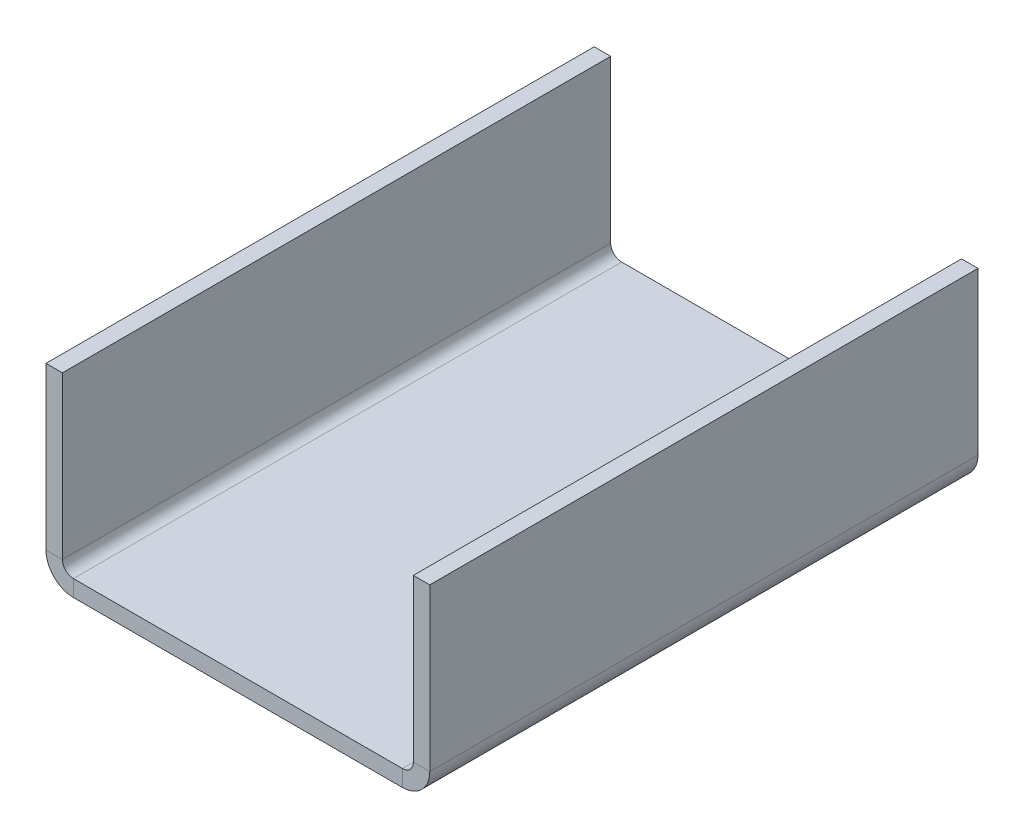
ISO-10303-21;
HEADER;
FILE_DESCRIPTION(('STEP AP214'),'2;1');
FILE_NAME('part.step','',(''),(''),'','','');
FILE_SCHEMA(('AUTOMOTIVE_DESIGN { 1 0 10303 214 1 1 1 1 }'));
ENDSEC;
DATA;
#1=APPLICATION_CONTEXT('core data for automotive mechanical design processes');
#2=APPLICATION_PROTOCOL_DEFINITION('international standard','automotive_design',2000,#1);
#3=PRODUCT_CONTEXT('',#1,'mechanical');
#4=PRODUCT('Part','Part','',(#3));
#5=PRODUCT_RELATED_PRODUCT_CATEGORY('part','',(#4));
#6=PRODUCT_DEFINITION_FORMATION('','',#4);
#7=PRODUCT_DEFINITION_CONTEXT('part definition',#1,'design');
#8=PRODUCT_DEFINITION('design','',#6,#7);
#9=PRODUCT_DEFINITION_SHAPE('','',#8);
#10=(LENGTH_UNIT() NAMED_UNIT(*) SI_UNIT(.MILLI.,.METRE.));
#11=(NAMED_UNIT(*) PLANE_ANGLE_UNIT() SI_UNIT($,.RADIAN.));
#12=(NAMED_UNIT(*) SI_UNIT($,.STERADIAN.) SOLID_ANGLE_UNIT());
#13=UNCERTAINTY_MEASURE_WITH_UNIT(LENGTH_MEASURE(1.E-05),#10,'distance_accuracy_value','');
#14=(GEOMETRIC_REPRESENTATION_CONTEXT(3) GLOBAL_UNCERTAINTY_ASSIGNED_CONTEXT((#13)) GLOBAL_UNIT_ASSIGNED_CONTEXT((#10,
#11,#12)) REPRESENTATION_CONTEXT('',''));
#15=CARTESIAN_POINT('',(0.,0.,0.));
#16=DIRECTION('',(0.,0.,1.));
#17=DIRECTION('',(1.,0.,0.));
#18=AXIS2_PLACEMENT_3D('',#15,#16,#17);
#19=CARTESIAN_POINT('',(0.,0.,0.));
#20=DIRECTION('',(0.,1.,0.));
#21=DIRECTION('',(0.,0.,1.));
#22=AXIS2_PLACEMENT_3D('',#19,#20,#21);
#23=PLANE('',#22);
#24=DIRECTION('',(1.,0.,0.));
#25=VECTOR('',#24,1.);
#26=CARTESIAN_POINT('',(-65.,0.,50.));
#27=LINE('',#26,#25);
#28=CARTESIAN_POINT('',(-30.,0.,50.));
#29=VERTEX_POINT('',#28);
#30=CARTESIAN_POINT('',(30.,0.,50.));
#31=VERTEX_POINT('',#30);
#32=EDGE_CURVE('E247',#29,#31,#27,.T.);
#33=ORIENTED_EDGE('',*,*,#32,.T.);
#34=DIRECTION('',(0.,0.,-1.));
#35=VECTOR('',#34,1.);
#36=CARTESIAN_POINT('',(30.,0.,0.));
#37=LINE('',#36,#35);
#38=CARTESIAN_POINT('',(30.,0.,-50.));
#39=VERTEX_POINT('',#38);
#40=EDGE_CURVE('E54',#31,#39,#37,.T.);
#41=ORIENTED_EDGE('',*,*,#40,.T.);
#42=DIRECTION('',(-1.,0.,0.));
#43=VECTOR('',#42,1.);
#44=CARTESIAN_POINT('',(-65.,0.,-50.));
#45=LINE('',#44,#43);
#46=CARTESIAN_POINT('',(-30.,0.,-50.));
#47=VERTEX_POINT('',#46);
#48=EDGE_CURVE('E70',#39,#47,#45,.T.);
#49=ORIENTED_EDGE('',*,*,#48,.T.);
#50=DIRECTION('',(0.,0.,-1.));
#51=VECTOR('',#50,1.);
#52=CARTESIAN_POINT('',(-30.,0.,0.));
#53=LINE('',#52,#51);
#54=EDGE_CURVE('E233',#29,#47,#53,.T.);
#55=ORIENTED_EDGE('',*,*,#54,.F.);
#56=EDGE_LOOP('',(#33,#41,#49,#55));
#57=FACE_BOUND('',#56,.T.);
#58=ADVANCED_FACE('F45',(#57),#23,.T.);
#59=CARTESIAN_POINT('',(-65.,-3.,-50.));
#60=DIRECTION('',(0.,0.,-1.));
#61=DIRECTION('',(-1.,0.,0.));
#62=AXIS2_PLACEMENT_3D('',#59,#60,#61);
#63=PLANE('',#62);
#64=ORIENTED_EDGE('',*,*,#48,.F.);
#65=DIRECTION('',(0.,-1.,0.));
#66=VECTOR('',#65,1.);
#67=CARTESIAN_POINT('',(30.,-3.,-50.));
#68=LINE('',#67,#66);
#69=CARTESIAN_POINT('',(30.,-3.,-50.));
#70=VERTEX_POINT('',#69);
#71=EDGE_CURVE('E241',#39,#70,#68,.T.);
#72=ORIENTED_EDGE('',*,*,#71,.T.);
#73=DIRECTION('',(-1.,0.,0.));
#74=VECTOR('',#73,1.);
#75=CARTESIAN_POINT('',(-65.,-3.,-50.));
#76=LINE('',#75,#74);
#77=CARTESIAN_POINT('',(-30.,-3.,-50.));
#78=VERTEX_POINT('',#77);
#79=EDGE_CURVE('E49',#70,#78,#76,.T.);
#80=ORIENTED_EDGE('',*,*,#79,.T.);
#81=DIRECTION('',(0.,-1.,0.));
#82=VECTOR('',#81,1.);
#83=CARTESIAN_POINT('',(-30.,-3.,-50.));
#84=LINE('',#83,#82);
#85=EDGE_CURVE('E236',#47,#78,#84,.T.);
#86=ORIENTED_EDGE('',*,*,#85,.F.);
#87=EDGE_LOOP('',(#64,#72,#80,#86));
#88=FACE_BOUND('',#87,.T.);
#89=ADVANCED_FACE('F252',(#88),#63,.T.);
#90=CARTESIAN_POINT('',(-65.,-3.,50.));
#91=DIRECTION('',(0.,0.,1.));
#92=DIRECTION('',(1.,0.,0.));
#93=AXIS2_PLACEMENT_3D('',#90,#91,#92);
#94=PLANE('',#93);
#95=DIRECTION('',(1.,0.,0.));
#96=VECTOR('',#95,1.);
#97=CARTESIAN_POINT('',(-65.,-3.,50.));
#98=LINE('',#97,#96);
#99=CARTESIAN_POINT('',(-30.,-3.,50.));
#100=VERTEX_POINT('',#99);
#101=CARTESIAN_POINT('',(30.,-3.,50.));
#102=VERTEX_POINT('',#101);
#103=EDGE_CURVE('E230',#100,#102,#98,.T.);
#104=ORIENTED_EDGE('',*,*,#103,.T.);
#105=DIRECTION('',(0.,1.,0.));
#106=VECTOR('',#105,1.);
#107=CARTESIAN_POINT('',(30.,-3.,50.));
#108=LINE('',#107,#106);
#109=EDGE_CURVE('E12',#102,#31,#108,.T.);
#110=ORIENTED_EDGE('',*,*,#109,.T.);
#111=ORIENTED_EDGE('',*,*,#32,.F.);
#112=DIRECTION('',(0.,1.,0.));
#113=VECTOR('',#112,1.);
#114=CARTESIAN_POINT('',(-30.,-3.,50.));
#115=LINE('',#114,#113);
#116=EDGE_CURVE('E229',#100,#29,#115,.T.);
#117=ORIENTED_EDGE('',*,*,#116,.F.);
#118=EDGE_LOOP('',(#104,#110,#111,#117));
#119=FACE_BOUND('',#118,.T.);
#120=ADVANCED_FACE('F47',(#119),#94,.T.);
#121=CARTESIAN_POINT('',(0.,-3.,0.));
#122=DIRECTION('',(0.,1.,0.));
#123=DIRECTION('',(0.,0.,1.));
#124=AXIS2_PLACEMENT_3D('',#121,#122,#123);
#125=PLANE('',#124);
#126=DIRECTION('',(0.,0.,-1.));
#127=VECTOR('',#126,1.);
#128=CARTESIAN_POINT('',(30.,-3.,0.));
#129=LINE('',#128,#127);
#130=EDGE_CURVE('E239',#102,#70,#129,.T.);
#131=ORIENTED_EDGE('',*,*,#130,.F.);
#132=ORIENTED_EDGE('',*,*,#103,.F.);
#133=DIRECTION('',(0.,0.,-1.));
#134=VECTOR('',#133,1.);
#135=CARTESIAN_POINT('',(-30.,-3.,0.));
#136=LINE('',#135,#134);
#137=EDGE_CURVE('E227',#100,#78,#136,.T.);
#138=ORIENTED_EDGE('',*,*,#137,.T.);
#139=ORIENTED_EDGE('',*,*,#79,.F.);
#140=EDGE_LOOP('',(#131,#132,#138,#139));
#141=FACE_BOUND('',#140,.T.);
#142=ADVANCED_FACE('F303',(#141),#125,.F.);
#143=CARTESIAN_POINT('',(-30.,2.,50.));
#144=DIRECTION('',(0.,0.,1.));
#145=DIRECTION('',(1.,0.,0.));
#146=AXIS2_PLACEMENT_3D('',#143,#144,#145);
#147=PLANE('',#146);
#148=ORIENTED_EDGE('',*,*,#116,.T.);
#149=CARTESIAN_POINT('',(-30.,2.,50.));
#150=DIRECTION('',(0.,0.,-1.));
#151=DIRECTION('',(-1.,0.,0.));
#152=AXIS2_PLACEMENT_3D('',#149,#150,#151);
#153=CIRCLE('',#152,2.);
#154=CARTESIAN_POINT('',(-32.,2.00000000000001,50.));
#155=VERTEX_POINT('',#154);
#156=EDGE_CURVE('E188',#29,#155,#153,.T.);
#157=ORIENTED_EDGE('',*,*,#156,.T.);
#158=DIRECTION('',(1.,0.,0.));
#159=VECTOR('',#158,1.);
#160=CARTESIAN_POINT('',(-35.,2.00000000000002,50.));
#161=LINE('',#160,#159);
#162=CARTESIAN_POINT('',(-35.,2.00000000000003,50.));
#163=VERTEX_POINT('',#162);
#164=EDGE_CURVE('E203',#163,#155,#161,.T.);
#165=ORIENTED_EDGE('',*,*,#164,.F.);
#166=CARTESIAN_POINT('',(-30.,2.,50.));
#167=DIRECTION('',(0.,0.,-1.));
#168=DIRECTION('',(1.,0.,0.));
#169=AXIS2_PLACEMENT_3D('',#166,#167,#168);
#170=CIRCLE('',#169,5.);
#171=EDGE_CURVE('E216',#100,#163,#170,.T.);
#172=ORIENTED_EDGE('',*,*,#171,.F.);
#173=EDGE_LOOP('',(#148,#157,#165,#172));
#174=FACE_BOUND('',#173,.T.);
#175=ADVANCED_FACE('F275',(#174),#147,.T.);
#176=CARTESIAN_POINT('',(-30.,2.,-50.));
#177=DIRECTION('',(0.,0.,-1.));
#178=DIRECTION('',(-1.,0.,0.));
#179=AXIS2_PLACEMENT_3D('',#176,#177,#178);
#180=PLANE('',#179);
#181=DIRECTION('',(-1.,0.,0.));
#182=VECTOR('',#181,1.);
#183=CARTESIAN_POINT('',(-35.,2.00000000000002,-50.));
#184=LINE('',#183,#182);
#185=CARTESIAN_POINT('',(-32.,2.00000000000001,-50.));
#186=VERTEX_POINT('',#185);
#187=CARTESIAN_POINT('',(-35.,2.00000000000002,-50.));
#188=VERTEX_POINT('',#187);
#189=EDGE_CURVE('E191',#186,#188,#184,.T.);
#190=ORIENTED_EDGE('',*,*,#189,.F.);
#191=CARTESIAN_POINT('',(-30.,2.,-50.));
#192=DIRECTION('',(0.,0.,-1.));
#193=DIRECTION('',(-1.,0.,0.));
#194=AXIS2_PLACEMENT_3D('',#191,#192,#193);
#195=CIRCLE('',#194,2.);
#196=EDGE_CURVE('E220',#186,#47,#195,.F.);
#197=ORIENTED_EDGE('',*,*,#196,.T.);
#198=ORIENTED_EDGE('',*,*,#85,.T.);
#199=CARTESIAN_POINT('',(-30.,2.,-50.));
#200=DIRECTION('',(0.,0.,1.));
#201=DIRECTION('',(-1.,0.,0.));
#202=AXIS2_PLACEMENT_3D('',#199,#200,#201);
#203=CIRCLE('',#202,5.);
#204=EDGE_CURVE('E219',#188,#78,#203,.T.);
#205=ORIENTED_EDGE('',*,*,#204,.F.);
#206=EDGE_LOOP('',(#190,#197,#198,#205));
#207=FACE_BOUND('',#206,.T.);
#208=ADVANCED_FACE('F258',(#207),#180,.T.);
#209=CARTESIAN_POINT('',(-30.,2.,100.195936362102));
#210=DIRECTION('',(0.,0.,-1.));
#211=DIRECTION('',(-1.,0.,0.));
#212=AXIS2_PLACEMENT_3D('',#209,#210,#211);
#213=CYLINDRICAL_SURFACE('',#212,5.);
#214=ORIENTED_EDGE('',*,*,#204,.T.);
#215=ORIENTED_EDGE('',*,*,#137,.F.);
#216=ORIENTED_EDGE('',*,*,#171,.T.);
#217=DIRECTION('',(0.,0.,-1.));
#218=VECTOR('',#217,1.);
#219=CARTESIAN_POINT('',(-35.,2.00000000000002,0.));
#220=LINE('',#219,#218);
#221=EDGE_CURVE('E181',#163,#188,#220,.T.);
#222=ORIENTED_EDGE('',*,*,#221,.T.);
#223=EDGE_LOOP('',(#214,#215,#216,#222));
#224=FACE_BOUND('',#223,.T.);
#225=ADVANCED_FACE('F262',(#224),#213,.T.);
#226=CARTESIAN_POINT('',(-30.,2.,100.195936362102));
#227=DIRECTION('',(0.,0.,-1.));
#228=DIRECTION('',(-1.,0.,0.));
#229=AXIS2_PLACEMENT_3D('',#226,#227,#228);
#230=CYLINDRICAL_SURFACE('',#229,2.);
#231=ORIENTED_EDGE('',*,*,#196,.F.);
#232=DIRECTION('',(0.,0.,-1.));
#233=VECTOR('',#232,1.);
#234=CARTESIAN_POINT('',(-32.,2.00000000000001,0.));
#235=LINE('',#234,#233);
#236=EDGE_CURVE('E198',#155,#186,#235,.T.);
#237=ORIENTED_EDGE('',*,*,#236,.F.);
#238=ORIENTED_EDGE('',*,*,#156,.F.);
#239=ORIENTED_EDGE('',*,*,#54,.T.);
#240=EDGE_LOOP('',(#231,#237,#238,#239));
#241=FACE_BOUND('',#240,.T.);
#242=ADVANCED_FACE('F279',(#241),#230,.F.);
#243=CARTESIAN_POINT('',(-34.9999999999999,31.5022128562179,-50.));
#244=DIRECTION('',(0.,1.,0.));
#245=DIRECTION('',(0.,0.,1.));
#246=AXIS2_PLACEMENT_3D('',#243,#244,#245);
#247=PLANE('',#246);
#248=DIRECTION('',(0.,0.,1.));
#249=VECTOR('',#248,1.);
#250=CARTESIAN_POINT('',(-31.9999999999999,31.5022128562179,-50.));
#251=LINE('',#250,#249);
#252=CARTESIAN_POINT('',(-31.9999999999999,31.5022128562179,-50.));
#253=VERTEX_POINT('',#252);
#254=CARTESIAN_POINT('',(-31.9999999999999,31.5022128562179,50.));
#255=VERTEX_POINT('',#254);
#256=EDGE_CURVE('E193',#253,#255,#251,.T.);
#257=ORIENTED_EDGE('',*,*,#256,.F.);
#258=DIRECTION('',(1.,0.,0.));
#259=VECTOR('',#258,1.);
#260=CARTESIAN_POINT('',(-34.9999999999999,31.5022128562179,-50.));
#261=LINE('',#260,#259);
#262=CARTESIAN_POINT('',(-34.9999999999999,31.5022128562179,-50.));
#263=VERTEX_POINT('',#262);
#264=EDGE_CURVE('E185',#263,#253,#261,.T.);
#265=ORIENTED_EDGE('',*,*,#264,.F.);
#266=DIRECTION('',(0.,0.,1.));
#267=VECTOR('',#266,1.);
#268=CARTESIAN_POINT('',(-34.9999999999999,31.5022128562179,-50.));
#269=LINE('',#268,#267);
#270=CARTESIAN_POINT('',(-34.9999999999999,31.5022128562179,50.));
#271=VERTEX_POINT('',#270);
#272=EDGE_CURVE('E211',#263,#271,#269,.T.);
#273=ORIENTED_EDGE('',*,*,#272,.T.);
#274=DIRECTION('',(1.,0.,0.));
#275=VECTOR('',#274,1.);
#276=CARTESIAN_POINT('',(-34.9999999999999,31.5022128562179,50.));
#277=LINE('',#276,#275);
#278=EDGE_CURVE('E209',#271,#255,#277,.T.);
#279=ORIENTED_EDGE('',*,*,#278,.T.);
#280=EDGE_LOOP('',(#257,#265,#273,#279));
#281=FACE_BOUND('',#280,.T.);
#282=ADVANCED_FACE('F287',(#281),#247,.T.);
#283=CARTESIAN_POINT('',(-35.0000000000001,-33.4977871437821,0.));
#284=DIRECTION('',(1.,0.,0.));
#285=DIRECTION('',(0.,0.,1.));
#286=AXIS2_PLACEMENT_3D('',#283,#284,#285);
#287=PLANE('',#286);
#288=ORIENTED_EDGE('',*,*,#221,.F.);
#289=DIRECTION('',(0.,-1.,0.));
#290=VECTOR('',#289,1.);
#291=CARTESIAN_POINT('',(-34.9999999999999,31.5022128562179,50.));
#292=LINE('',#291,#290);
#293=EDGE_CURVE('E206',#271,#163,#292,.T.);
#294=ORIENTED_EDGE('',*,*,#293,.F.);
#295=ORIENTED_EDGE('',*,*,#272,.F.);
#296=DIRECTION('',(0.,1.,0.));
#297=VECTOR('',#296,1.);
#298=CARTESIAN_POINT('',(-34.9999999999999,31.5022128562179,-50.));
#299=LINE('',#298,#297);
#300=EDGE_CURVE('E189',#188,#263,#299,.T.);
#301=ORIENTED_EDGE('',*,*,#300,.F.);
#302=EDGE_LOOP('',(#288,#294,#295,#301));
#303=FACE_BOUND('',#302,.T.);
#304=ADVANCED_FACE('F267',(#303),#287,.F.);
#305=CARTESIAN_POINT('',(-34.9999999999999,31.5022128562179,50.));
#306=DIRECTION('',(0.,0.,1.));
#307=DIRECTION('',(0.,-1.,0.));
#308=AXIS2_PLACEMENT_3D('',#305,#306,#307);
#309=PLANE('',#308);
#310=ORIENTED_EDGE('',*,*,#293,.T.);
#311=ORIENTED_EDGE('',*,*,#164,.T.);
#312=DIRECTION('',(0.,-1.,0.));
#313=VECTOR('',#312,1.);
#314=CARTESIAN_POINT('',(-31.9999999999999,31.5022128562179,50.));
#315=LINE('',#314,#313);
#316=EDGE_CURVE('E201',#255,#155,#315,.T.);
#317=ORIENTED_EDGE('',*,*,#316,.F.);
#318=ORIENTED_EDGE('',*,*,#278,.F.);
#319=EDGE_LOOP('',(#310,#311,#317,#318));
#320=FACE_BOUND('',#319,.T.);
#321=ADVANCED_FACE('F271',(#320),#309,.T.);
#322=CARTESIAN_POINT('',(-32.0000000000001,-33.4977871437821,0.));
#323=DIRECTION('',(1.,0.,0.));
#324=DIRECTION('',(0.,0.,1.));
#325=AXIS2_PLACEMENT_3D('',#322,#323,#324);
#326=PLANE('',#325);
#327=ORIENTED_EDGE('',*,*,#316,.T.);
#328=ORIENTED_EDGE('',*,*,#236,.T.);
#329=DIRECTION('',(0.,1.,0.));
#330=VECTOR('',#329,1.);
#331=CARTESIAN_POINT('',(-31.9999999999999,31.5022128562179,-50.));
#332=LINE('',#331,#330);
#333=EDGE_CURVE('E196',#186,#253,#332,.T.);
#334=ORIENTED_EDGE('',*,*,#333,.T.);
#335=ORIENTED_EDGE('',*,*,#256,.T.);
#336=EDGE_LOOP('',(#327,#328,#334,#335));
#337=FACE_BOUND('',#336,.T.);
#338=ADVANCED_FACE('F281',(#337),#326,.T.);
#339=CARTESIAN_POINT('',(-34.9999999999999,31.5022128562179,-50.));
#340=DIRECTION('',(0.,0.,-1.));
#341=DIRECTION('',(0.,1.,0.));
#342=AXIS2_PLACEMENT_3D('',#339,#340,#341);
#343=PLANE('',#342);
#344=ORIENTED_EDGE('',*,*,#333,.F.);
#345=ORIENTED_EDGE('',*,*,#189,.T.);
#346=ORIENTED_EDGE('',*,*,#300,.T.);
#347=ORIENTED_EDGE('',*,*,#264,.T.);
#348=EDGE_LOOP('',(#344,#345,#346,#347));
#349=FACE_BOUND('',#348,.T.);
#350=ADVANCED_FACE('F283',(#349),#343,.T.);
#351=CARTESIAN_POINT('',(30.,2.,50.));
#352=DIRECTION('',(0.,0.,1.));
#353=DIRECTION('',(1.,0.,0.));
#354=AXIS2_PLACEMENT_3D('',#351,#352,#353);
#355=PLANE('',#354);
#356=DIRECTION('',(-1.,0.,0.));
#357=VECTOR('',#356,1.);
#358=CARTESIAN_POINT('',(35.,2.00000000000002,50.));
#359=LINE('',#358,#357);
#360=CARTESIAN_POINT('',(35.,2.00000000000001,50.));
#361=VERTEX_POINT('',#360);
#362=CARTESIAN_POINT('',(32.,2.,50.));
#363=VERTEX_POINT('',#362);
#364=EDGE_CURVE('E144',#361,#363,#359,.T.);
#365=ORIENTED_EDGE('',*,*,#364,.T.);
#366=CARTESIAN_POINT('',(30.,2.,50.));
#367=DIRECTION('',(0.,0.,1.));
#368=DIRECTION('',(1.,0.,0.));
#369=AXIS2_PLACEMENT_3D('',#366,#367,#368);
#370=CIRCLE('',#369,2.);
#371=EDGE_CURVE('E62',#363,#31,#370,.F.);
#372=ORIENTED_EDGE('',*,*,#371,.T.);
#373=ORIENTED_EDGE('',*,*,#109,.F.);
#374=CARTESIAN_POINT('',(30.,2.,50.));
#375=DIRECTION('',(0.,0.,-1.));
#376=DIRECTION('',(1.,0.,0.));
#377=AXIS2_PLACEMENT_3D('',#374,#375,#376);
#378=CIRCLE('',#377,5.);
#379=EDGE_CURVE('E174',#361,#102,#378,.T.);
#380=ORIENTED_EDGE('',*,*,#379,.F.);
#381=EDGE_LOOP('',(#365,#372,#373,#380));
#382=FACE_BOUND('',#381,.T.);
#383=ADVANCED_FACE('F314',(#382),#355,.T.);
#384=CARTESIAN_POINT('',(30.,2.,-50.));
#385=DIRECTION('',(0.,0.,-1.));
#386=DIRECTION('',(-1.,0.,0.));
#387=AXIS2_PLACEMENT_3D('',#384,#385,#386);
#388=PLANE('',#387);
#389=CARTESIAN_POINT('',(30.,2.,-50.));
#390=DIRECTION('',(0.,0.,1.));
#391=DIRECTION('',(1.,0.,0.));
#392=AXIS2_PLACEMENT_3D('',#389,#390,#391);
#393=CIRCLE('',#392,2.);
#394=CARTESIAN_POINT('',(32.,2.00000000000002,-50.));
#395=VERTEX_POINT('',#394);
#396=EDGE_CURVE('E178',#39,#395,#393,.T.);
#397=ORIENTED_EDGE('',*,*,#396,.T.);
#398=DIRECTION('',(1.,0.,0.));
#399=VECTOR('',#398,1.);
#400=CARTESIAN_POINT('',(35.,2.00000000000003,-50.));
#401=LINE('',#400,#399);
#402=CARTESIAN_POINT('',(35.,2.00000000000003,-50.));
#403=VERTEX_POINT('',#402);
#404=EDGE_CURVE('E162',#395,#403,#401,.T.);
#405=ORIENTED_EDGE('',*,*,#404,.T.);
#406=CARTESIAN_POINT('',(30.,2.,-50.));
#407=DIRECTION('',(0.,0.,1.));
#408=DIRECTION('',(-1.,0.,0.));
#409=AXIS2_PLACEMENT_3D('',#406,#407,#408);
#410=CIRCLE('',#409,5.);
#411=EDGE_CURVE('E177',#70,#403,#410,.T.);
#412=ORIENTED_EDGE('',*,*,#411,.F.);
#413=ORIENTED_EDGE('',*,*,#71,.F.);
#414=EDGE_LOOP('',(#397,#405,#412,#413));
#415=FACE_BOUND('',#414,.T.);
#416=ADVANCED_FACE('F336',(#415),#388,.T.);
#417=CARTESIAN_POINT('',(30.,2.,-100.195936362102));
#418=DIRECTION('',(0.,0.,1.));
#419=DIRECTION('',(1.,0.,0.));
#420=AXIS2_PLACEMENT_3D('',#417,#418,#419);
#421=CYLINDRICAL_SURFACE('',#420,5.);
#422=ORIENTED_EDGE('',*,*,#130,.T.);
#423=ORIENTED_EDGE('',*,*,#411,.T.);
#424=DIRECTION('',(0.,0.,-1.));
#425=VECTOR('',#424,1.);
#426=CARTESIAN_POINT('',(35.,2.00000000000002,0.));
#427=LINE('',#426,#425);
#428=EDGE_CURVE('E164',#361,#403,#427,.T.);
#429=ORIENTED_EDGE('',*,*,#428,.F.);
#430=ORIENTED_EDGE('',*,*,#379,.T.);
#431=EDGE_LOOP('',(#422,#423,#429,#430));
#432=FACE_BOUND('',#431,.T.);
#433=ADVANCED_FACE('F343',(#432),#421,.T.);
#434=CARTESIAN_POINT('',(30.,2.,-100.195936362102));
#435=DIRECTION('',(0.,0.,1.));
#436=DIRECTION('',(1.,0.,0.));
#437=AXIS2_PLACEMENT_3D('',#434,#435,#436);
#438=CYLINDRICAL_SURFACE('',#437,2.);
#439=ORIENTED_EDGE('',*,*,#40,.F.);
#440=ORIENTED_EDGE('',*,*,#371,.F.);
#441=DIRECTION('',(0.,0.,-1.));
#442=VECTOR('',#441,1.);
#443=CARTESIAN_POINT('',(32.,2.00000000000001,0.));
#444=LINE('',#443,#442);
#445=EDGE_CURVE('E167',#363,#395,#444,.T.);
#446=ORIENTED_EDGE('',*,*,#445,.T.);
#447=ORIENTED_EDGE('',*,*,#396,.F.);
#448=EDGE_LOOP('',(#439,#440,#446,#447));
#449=FACE_BOUND('',#448,.T.);
#450=ADVANCED_FACE('F350',(#449),#438,.F.);
#451=CARTESIAN_POINT('',(34.9999999999999,31.5022128562179,-50.));
#452=DIRECTION('',(0.,1.,0.));
#453=DIRECTION('',(0.,0.,-1.));
#454=AXIS2_PLACEMENT_3D('',#451,#452,#453);
#455=PLANE('',#454);
#456=DIRECTION('',(0.,0.,-1.));
#457=VECTOR('',#456,1.);
#458=CARTESIAN_POINT('',(31.9999999999999,31.5022128562178,-50.));
#459=LINE('',#458,#457);
#460=CARTESIAN_POINT('',(31.9999999999999,31.5022128562179,50.));
#461=VERTEX_POINT('',#460);
#462=CARTESIAN_POINT('',(31.9999999999999,31.5022128562178,-50.));
#463=VERTEX_POINT('',#462);
#464=EDGE_CURVE('E155',#461,#463,#459,.T.);
#465=ORIENTED_EDGE('',*,*,#464,.F.);
#466=DIRECTION('',(-1.,0.,0.));
#467=VECTOR('',#466,1.);
#468=CARTESIAN_POINT('',(34.9999999999999,31.5022128562179,50.));
#469=LINE('',#468,#467);
#470=CARTESIAN_POINT('',(34.9999999999999,31.5022128562179,50.));
#471=VERTEX_POINT('',#470);
#472=EDGE_CURVE('E142',#471,#461,#469,.T.);
#473=ORIENTED_EDGE('',*,*,#472,.F.);
#474=DIRECTION('',(0.,0.,-1.));
#475=VECTOR('',#474,1.);
#476=CARTESIAN_POINT('',(34.9999999999999,31.5022128562179,-50.));
#477=LINE('',#476,#475);
#478=CARTESIAN_POINT('',(34.9999999999999,31.5022128562179,-50.));
#479=VERTEX_POINT('',#478);
#480=EDGE_CURVE('E153',#471,#479,#477,.T.);
#481=ORIENTED_EDGE('',*,*,#480,.T.);
#482=DIRECTION('',(-1.,0.,0.));
#483=VECTOR('',#482,1.);
#484=CARTESIAN_POINT('',(34.9999999999999,31.5022128562179,-50.));
#485=LINE('',#484,#483);
#486=EDGE_CURVE('E161',#479,#463,#485,.T.);
#487=ORIENTED_EDGE('',*,*,#486,.T.);
#488=EDGE_LOOP('',(#465,#473,#481,#487));
#489=FACE_BOUND('',#488,.T.);
#490=ADVANCED_FACE('F152',(#489),#455,.T.);
#491=CARTESIAN_POINT('',(35.0000000000001,-33.4977871437821,0.));
#492=DIRECTION('',(-1.,0.,0.));
#493=DIRECTION('',(0.,0.,1.));
#494=AXIS2_PLACEMENT_3D('',#491,#492,#493);
#495=PLANE('',#494);
#496=DIRECTION('',(0.,1.,0.));
#497=VECTOR('',#496,1.);
#498=CARTESIAN_POINT('',(35.0000000000003,-98.4977871437822,50.));
#499=LINE('',#498,#497);
#500=EDGE_CURVE('E139',#361,#471,#499,.T.);
#501=ORIENTED_EDGE('',*,*,#500,.F.);
#502=ORIENTED_EDGE('',*,*,#428,.T.);
#503=DIRECTION('',(0.,-1.,0.));
#504=VECTOR('',#503,1.);
#505=CARTESIAN_POINT('',(35.0000000000003,-98.4977871437822,-50.));
#506=LINE('',#505,#504);
#507=EDGE_CURVE('E160',#479,#403,#506,.T.);
#508=ORIENTED_EDGE('',*,*,#507,.F.);
#509=ORIENTED_EDGE('',*,*,#480,.F.);
#510=EDGE_LOOP('',(#501,#502,#508,#509));
#511=FACE_BOUND('',#510,.T.);
#512=ADVANCED_FACE('F158',(#511),#495,.F.);
#513=CARTESIAN_POINT('',(35.0000000000003,-98.4977871437822,-50.));
#514=DIRECTION('',(0.,0.,-1.));
#515=DIRECTION('',(0.,-1.,0.));
#516=AXIS2_PLACEMENT_3D('',#513,#514,#515);
#517=PLANE('',#516);
#518=ORIENTED_EDGE('',*,*,#404,.F.);
#519=DIRECTION('',(0.,-1.,0.));
#520=VECTOR('',#519,1.);
#521=CARTESIAN_POINT('',(32.0000000000003,-98.4977871437822,-50.));
#522=LINE('',#521,#520);
#523=EDGE_CURVE('E148',#463,#395,#522,.T.);
#524=ORIENTED_EDGE('',*,*,#523,.F.);
#525=ORIENTED_EDGE('',*,*,#486,.F.);
#526=ORIENTED_EDGE('',*,*,#507,.T.);
#527=EDGE_LOOP('',(#518,#524,#525,#526));
#528=FACE_BOUND('',#527,.T.);
#529=ADVANCED_FACE('F371',(#528),#517,.T.);
#530=CARTESIAN_POINT('',(32.0000000000001,-33.4977871437821,0.));
#531=DIRECTION('',(-1.,0.,0.));
#532=DIRECTION('',(0.,0.,1.));
#533=AXIS2_PLACEMENT_3D('',#530,#531,#532);
#534=PLANE('',#533);
#535=ORIENTED_EDGE('',*,*,#445,.F.);
#536=DIRECTION('',(0.,1.,0.));
#537=VECTOR('',#536,1.);
#538=CARTESIAN_POINT('',(32.0000000000004,-98.4977871437822,50.));
#539=LINE('',#538,#537);
#540=EDGE_CURVE('E525',#363,#461,#539,.T.);
#541=ORIENTED_EDGE('',*,*,#540,.T.);
#542=ORIENTED_EDGE('',*,*,#464,.T.);
#543=ORIENTED_EDGE('',*,*,#523,.T.);
#544=EDGE_LOOP('',(#535,#541,#542,#543));
#545=FACE_BOUND('',#544,.T.);
#546=ADVANCED_FACE('F378',(#545),#534,.T.);
#547=CARTESIAN_POINT('',(35.0000000000003,-98.4977871437822,50.));
#548=DIRECTION('',(0.,0.,1.));
#549=DIRECTION('',(0.,1.,0.));
#550=AXIS2_PLACEMENT_3D('',#547,#548,#549);
#551=PLANE('',#550);
#552=ORIENTED_EDGE('',*,*,#364,.F.);
#553=ORIENTED_EDGE('',*,*,#500,.T.);
#554=ORIENTED_EDGE('',*,*,#472,.T.);
#555=ORIENTED_EDGE('',*,*,#540,.F.);
#556=EDGE_LOOP('',(#552,#553,#554,#555));
#557=FACE_BOUND('',#556,.T.);
#558=ADVANCED_FACE('F141',(#557),#551,.T.);
#559=CLOSED_SHELL('',(#58,#89,#120,#142,#175,#208,#225,#242,#282,#304,#321,#338,#350,#383,#416,
#433,#450,#490,#512,#529,#546,#558));
#560=MANIFOLD_SOLID_BREP('B2',#559);
#561=ADVANCED_BREP_SHAPE_REPRESENTATION('',(#18,#560),#14);
#562=SHAPE_DEFINITION_REPRESENTATION(#9,#561);
ENDSEC;
END-ISO-10303-21;
